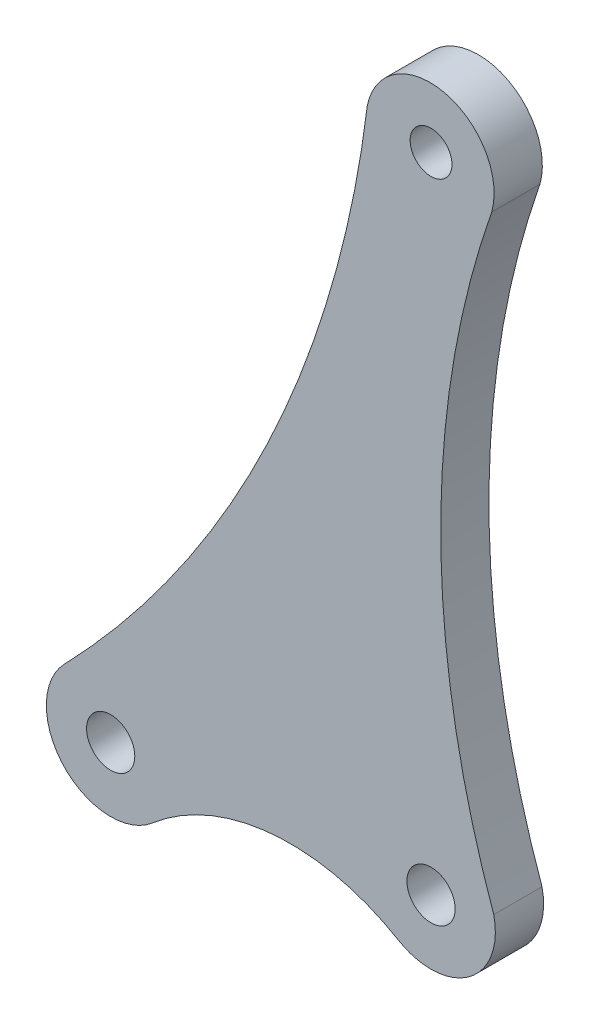
ISO-10303-21;
HEADER;
FILE_DESCRIPTION(('STEP AP214'),'2;1');
FILE_NAME('part.step','',(''),(''),'','','');
FILE_SCHEMA(('AUTOMOTIVE_DESIGN { 1 0 10303 214 1 1 1 1 }'));
ENDSEC;
DATA;
#1=APPLICATION_CONTEXT('core data for automotive mechanical design processes');
#2=APPLICATION_PROTOCOL_DEFINITION('international standard','automotive_design',2000,#1);
#3=PRODUCT_CONTEXT('',#1,'mechanical');
#4=PRODUCT('Part','Part','',(#3));
#5=PRODUCT_RELATED_PRODUCT_CATEGORY('part','',(#4));
#6=PRODUCT_DEFINITION_FORMATION('','',#4);
#7=PRODUCT_DEFINITION_CONTEXT('part definition',#1,'design');
#8=PRODUCT_DEFINITION('design','',#6,#7);
#9=PRODUCT_DEFINITION_SHAPE('','',#8);
#10=(LENGTH_UNIT() NAMED_UNIT(*) SI_UNIT(.MILLI.,.METRE.));
#11=(NAMED_UNIT(*) PLANE_ANGLE_UNIT() SI_UNIT($,.RADIAN.));
#12=(NAMED_UNIT(*) SI_UNIT($,.STERADIAN.) SOLID_ANGLE_UNIT());
#13=UNCERTAINTY_MEASURE_WITH_UNIT(LENGTH_MEASURE(1.E-05),#10,'distance_accuracy_value','');
#14=(GEOMETRIC_REPRESENTATION_CONTEXT(3) GLOBAL_UNCERTAINTY_ASSIGNED_CONTEXT((#13)) GLOBAL_UNIT_ASSIGNED_CONTEXT((#10,
#11,#12)) REPRESENTATION_CONTEXT('',''));
#15=CARTESIAN_POINT('',(0.,0.,0.));
#16=DIRECTION('',(0.,0.,1.));
#17=DIRECTION('',(1.,0.,0.));
#18=AXIS2_PLACEMENT_3D('',#15,#16,#17);
#19=CARTESIAN_POINT('',(0.761207058722107,54.9966930163416,3.));
#20=DIRECTION('',(0.,0.,1.));
#21=DIRECTION('',(1.,0.,0.));
#22=AXIS2_PLACEMENT_3D('',#19,#20,#21);
#23=PLANE('',#22);
#24=CARTESIAN_POINT('',(17.037547355421,8.92471756310351,3.));
#25=DIRECTION('',(0.,0.,1.));
#26=DIRECTION('',(1.,0.,0.));
#27=AXIS2_PLACEMENT_3D('',#24,#25,#26);
#28=CIRCLE('',#27,1.5);
#29=CARTESIAN_POINT('',(18.537547355421,8.92471756310351,3.));
#30=VERTEX_POINT('',#29);
#31=EDGE_CURVE('E165',#30,#30,#28,.T.);
#32=ORIENTED_EDGE('',*,*,#31,.F.);
#33=EDGE_LOOP('',(#32));
#34=FACE_BOUND('',#33,.T.);
#35=CARTESIAN_POINT('',(-35.3816029465135,59.570845149379,3.));
#36=DIRECTION('',(0.,0.,-1.));
#37=DIRECTION('',(1.,0.,0.));
#38=AXIS2_PLACEMENT_3D('',#35,#36,#37);
#39=CIRCLE('',#38,68.8890351769737);
#40=CARTESIAN_POINT('',(32.9915944209716,51.1562715201774,3.));
#41=VERTEX_POINT('',#40);
#42=CARTESIAN_POINT('',(14.1612277016737,11.7042900301794,3.));
#43=VERTEX_POINT('',#42);
#44=EDGE_CURVE('E138',#41,#43,#39,.T.);
#45=ORIENTED_EDGE('',*,*,#44,.T.);
#46=CARTESIAN_POINT('',(17.0380745657417,8.92509417856976,3.));
#47=DIRECTION('',(0.,0.,1.));
#48=DIRECTION('',(1.,0.,0.));
#49=AXIS2_PLACEMENT_3D('',#46,#47,#48);
#50=CIRCLE('',#49,4.00002218255129);
#51=CARTESIAN_POINT('',(19.6440331307402,5.8904348206824,3.));
#52=VERTEX_POINT('',#51);
#53=EDGE_CURVE('E91',#43,#52,#50,.T.);
#54=ORIENTED_EDGE('',*,*,#53,.T.);
#55=CARTESIAN_POINT('',(28.2139675514032,-4.08544303520237,3.));
#56=DIRECTION('',(0.,0.,-1.));
#57=DIRECTION('',(1.,0.,0.));
#58=AXIS2_PLACEMENT_3D('',#55,#56,#57);
#59=CIRCLE('',#58,13.151498582671);
#60=CARTESIAN_POINT('',(34.9213771509021,7.22705321604772,3.));
#61=VERTEX_POINT('',#60);
#62=EDGE_CURVE('E150',#52,#61,#59,.T.);
#63=ORIENTED_EDGE('',*,*,#62,.T.);
#64=CARTESIAN_POINT('',(36.9614276657235,10.6677663383811,3.));
#65=DIRECTION('',(0.,0.,1.));
#66=DIRECTION('',(1.,0.,0.));
#67=AXIS2_PLACEMENT_3D('',#64,#65,#66);
#68=CIRCLE('',#67,4.00003911146132);
#69=CARTESIAN_POINT('',(36.4627287067595,6.69893625363967,3.));
#70=VERTEX_POINT('',#69);
#71=EDGE_CURVE('E107',#61,#70,#68,.T.);
#72=ORIENTED_EDGE('',*,*,#71,.T.);
#73=CARTESIAN_POINT('',(36.956219654694,10.6744713366131,3.));
#74=DIRECTION('',(0.,0.,1.));
#75=DIRECTION('',(1.,0.,0.));
#76=AXIS2_PLACEMENT_3D('',#73,#74,#75);
#77=CIRCLE('',#76,4.00604699318991);
#78=CARTESIAN_POINT('',(40.8619361875601,11.5654207608467,3.));
#79=VERTEX_POINT('',#78);
#80=EDGE_CURVE('E101',#70,#79,#77,.T.);
#81=ORIENTED_EDGE('',*,*,#80,.T.);
#82=CARTESIAN_POINT('',(94.3239691330171,30.6328080953282,3.));
#83=DIRECTION('',(0.,0.,-1.));
#84=DIRECTION('',(1.,0.,0.));
#85=AXIS2_PLACEMENT_3D('',#82,#83,#84);
#86=CIRCLE('',#85,56.7604988211368);
#87=CARTESIAN_POINT('',(40.7336923062268,49.3367236226251,3.));
#88=VERTEX_POINT('',#87);
#89=EDGE_CURVE('E105',#79,#88,#86,.T.);
#90=ORIENTED_EDGE('',*,*,#89,.T.);
#91=CARTESIAN_POINT('',(36.9040170639577,50.4225408833042,3.));
#92=DIRECTION('',(0.,0.,1.));
#93=DIRECTION('',(1.,0.,0.));
#94=AXIS2_PLACEMENT_3D('',#91,#92,#93);
#95=CIRCLE('',#94,3.98062954629504);
#96=EDGE_CURVE('E51',#88,#41,#95,.T.);
#97=ORIENTED_EDGE('',*,*,#96,.T.);
#98=EDGE_LOOP('',(#45,#54,#63,#72,#81,#90,#97));
#99=FACE_BOUND('',#98,.T.);
#100=CARTESIAN_POINT('',(36.9616073475727,50.6676642755564,3.));
#101=DIRECTION('',(0.,0.,1.));
#102=DIRECTION('',(1.,0.,0.));
#103=AXIS2_PLACEMENT_3D('',#100,#101,#102);
#104=CIRCLE('',#103,1.3);
#105=CARTESIAN_POINT('',(38.2616073475727,50.6676642755564,3.));
#106=VERTEX_POINT('',#105);
#107=EDGE_CURVE('E129',#106,#106,#104,.T.);
#108=ORIENTED_EDGE('',*,*,#107,.F.);
#109=EDGE_LOOP('',(#108));
#110=FACE_BOUND('',#109,.T.);
#111=CARTESIAN_POINT('',(36.961484603523,10.6676207629864,3.));
#112=DIRECTION('',(0.,0.,1.));
#113=DIRECTION('',(1.,0.,0.));
#114=AXIS2_PLACEMENT_3D('',#111,#112,#113);
#115=CIRCLE('',#114,1.5);
#116=CARTESIAN_POINT('',(38.461484603523,10.6676207629864,3.));
#117=VERTEX_POINT('',#116);
#118=EDGE_CURVE('E171',#117,#117,#115,.T.);
#119=ORIENTED_EDGE('',*,*,#118,.F.);
#120=EDGE_LOOP('',(#119));
#121=FACE_BOUND('',#120,.T.);
#122=ADVANCED_FACE('F34',(#34,#99,#110,#121),#23,.T.);
#123=CARTESIAN_POINT('',(0.761207058722107,54.9966930163416,0.));
#124=DIRECTION('',(0.,0.,1.));
#125=DIRECTION('',(1.,0.,0.));
#126=AXIS2_PLACEMENT_3D('',#123,#124,#125);
#127=PLANE('',#126);
#128=CARTESIAN_POINT('',(-35.3816029465135,59.570845149379,0.));
#129=DIRECTION('',(0.,0.,-1.));
#130=DIRECTION('',(1.,0.,0.));
#131=AXIS2_PLACEMENT_3D('',#128,#129,#130);
#132=CIRCLE('',#131,68.8890351769737);
#133=CARTESIAN_POINT('',(32.9915944209716,51.1562715201774,0.));
#134=VERTEX_POINT('',#133);
#135=CARTESIAN_POINT('',(14.1612277016737,11.7042900301794,0.));
#136=VERTEX_POINT('',#135);
#137=EDGE_CURVE('E125',#134,#136,#132,.T.);
#138=ORIENTED_EDGE('',*,*,#137,.F.);
#139=CARTESIAN_POINT('',(36.9040170639577,50.4225408833042,0.));
#140=DIRECTION('',(0.,0.,1.));
#141=DIRECTION('',(1.,0.,0.));
#142=AXIS2_PLACEMENT_3D('',#139,#140,#141);
#143=CIRCLE('',#142,3.98062954629504);
#144=CARTESIAN_POINT('',(40.7336923062268,49.3367236226251,0.));
#145=VERTEX_POINT('',#144);
#146=EDGE_CURVE('E83',#145,#134,#143,.T.);
#147=ORIENTED_EDGE('',*,*,#146,.F.);
#148=CARTESIAN_POINT('',(94.3239691330171,30.6328080953282,0.));
#149=DIRECTION('',(0.,0.,-1.));
#150=DIRECTION('',(1.,0.,0.));
#151=AXIS2_PLACEMENT_3D('',#148,#149,#150);
#152=CIRCLE('',#151,56.7604988211368);
#153=CARTESIAN_POINT('',(40.8619361875601,11.5654207608467,0.));
#154=VERTEX_POINT('',#153);
#155=EDGE_CURVE('E77',#154,#145,#152,.T.);
#156=ORIENTED_EDGE('',*,*,#155,.F.);
#157=CARTESIAN_POINT('',(36.956219654694,10.6744713366131,0.));
#158=DIRECTION('',(0.,0.,1.));
#159=DIRECTION('',(1.,0.,0.));
#160=AXIS2_PLACEMENT_3D('',#157,#158,#159);
#161=CIRCLE('',#160,4.00604699318991);
#162=CARTESIAN_POINT('',(36.4627287067595,6.69893625363967,0.));
#163=VERTEX_POINT('',#162);
#164=EDGE_CURVE('E115',#163,#154,#161,.T.);
#165=ORIENTED_EDGE('',*,*,#164,.F.);
#166=CARTESIAN_POINT('',(36.9614276657235,10.6677663383811,0.));
#167=DIRECTION('',(0.,0.,1.));
#168=DIRECTION('',(1.,0.,0.));
#169=AXIS2_PLACEMENT_3D('',#166,#167,#168);
#170=CIRCLE('',#169,4.00003911146132);
#171=CARTESIAN_POINT('',(34.9213771509021,7.22705321604772,0.));
#172=VERTEX_POINT('',#171);
#173=EDGE_CURVE('E133',#172,#163,#170,.T.);
#174=ORIENTED_EDGE('',*,*,#173,.F.);
#175=CARTESIAN_POINT('',(28.2139675514032,-4.08544303520237,0.));
#176=DIRECTION('',(0.,0.,-1.));
#177=DIRECTION('',(1.,0.,0.));
#178=AXIS2_PLACEMENT_3D('',#175,#176,#177);
#179=CIRCLE('',#178,13.151498582671);
#180=CARTESIAN_POINT('',(19.6440331307402,5.8904348206824,0.));
#181=VERTEX_POINT('',#180);
#182=EDGE_CURVE('E131',#181,#172,#179,.T.);
#183=ORIENTED_EDGE('',*,*,#182,.F.);
#184=CARTESIAN_POINT('',(17.0380745657417,8.92509417856976,0.));
#185=DIRECTION('',(0.,0.,1.));
#186=DIRECTION('',(1.,0.,0.));
#187=AXIS2_PLACEMENT_3D('',#184,#185,#186);
#188=CIRCLE('',#187,4.00002218255129);
#189=EDGE_CURVE('E128',#136,#181,#188,.T.);
#190=ORIENTED_EDGE('',*,*,#189,.F.);
#191=EDGE_LOOP('',(#138,#147,#156,#165,#174,#183,#190));
#192=FACE_BOUND('',#191,.T.);
#193=CARTESIAN_POINT('',(36.9616073475727,50.6676642755564,0.));
#194=DIRECTION('',(0.,0.,1.));
#195=DIRECTION('',(1.,0.,0.));
#196=AXIS2_PLACEMENT_3D('',#193,#194,#195);
#197=CIRCLE('',#196,1.3);
#198=CARTESIAN_POINT('',(38.2616073475727,50.6676642755564,0.));
#199=VERTEX_POINT('',#198);
#200=EDGE_CURVE('E162',#199,#199,#197,.T.);
#201=ORIENTED_EDGE('',*,*,#200,.T.);
#202=EDGE_LOOP('',(#201));
#203=FACE_BOUND('',#202,.T.);
#204=CARTESIAN_POINT('',(17.037547355421,8.92471756310351,0.));
#205=DIRECTION('',(0.,0.,1.));
#206=DIRECTION('',(1.,0.,0.));
#207=AXIS2_PLACEMENT_3D('',#204,#205,#206);
#208=CIRCLE('',#207,1.5);
#209=CARTESIAN_POINT('',(18.537547355421,8.92471756310351,0.));
#210=VERTEX_POINT('',#209);
#211=EDGE_CURVE('E168',#210,#210,#208,.T.);
#212=ORIENTED_EDGE('',*,*,#211,.T.);
#213=EDGE_LOOP('',(#212));
#214=FACE_BOUND('',#213,.T.);
#215=CARTESIAN_POINT('',(36.961484603523,10.6676207629864,0.));
#216=DIRECTION('',(0.,0.,1.));
#217=DIRECTION('',(1.,0.,0.));
#218=AXIS2_PLACEMENT_3D('',#215,#216,#217);
#219=CIRCLE('',#218,1.5);
#220=CARTESIAN_POINT('',(38.461484603523,10.6676207629864,0.));
#221=VERTEX_POINT('',#220);
#222=EDGE_CURVE('E174',#221,#221,#219,.T.);
#223=ORIENTED_EDGE('',*,*,#222,.T.);
#224=EDGE_LOOP('',(#223));
#225=FACE_BOUND('',#224,.T.);
#226=ADVANCED_FACE('F154',(#192,#203,#214,#225),#127,.F.);
#227=CARTESIAN_POINT('',(-35.3816029465135,59.570845149379,3.));
#228=DIRECTION('',(0.,0.,-1.));
#229=DIRECTION('',(-1.,0.,0.));
#230=AXIS2_PLACEMENT_3D('',#227,#228,#229);
#231=CYLINDRICAL_SURFACE('',#230,68.8890351769737);
#232=ORIENTED_EDGE('',*,*,#137,.T.);
#233=DIRECTION('',(0.,0.,-1.));
#234=VECTOR('',#233,1.);
#235=CARTESIAN_POINT('',(14.1612277016737,11.7042900301794,3.));
#236=LINE('',#235,#234);
#237=EDGE_CURVE('E11',#43,#136,#236,.T.);
#238=ORIENTED_EDGE('',*,*,#237,.F.);
#239=ORIENTED_EDGE('',*,*,#44,.F.);
#240=DIRECTION('',(0.,0.,-1.));
#241=VECTOR('',#240,1.);
#242=CARTESIAN_POINT('',(32.9915944209716,51.1562715201774,3.));
#243=LINE('',#242,#241);
#244=EDGE_CURVE('E121',#41,#134,#243,.T.);
#245=ORIENTED_EDGE('',*,*,#244,.T.);
#246=EDGE_LOOP('',(#232,#238,#239,#245));
#247=FACE_BOUND('',#246,.T.);
#248=ADVANCED_FACE('F36',(#247),#231,.F.);
#249=CARTESIAN_POINT('',(17.0380745657417,8.92509417856976,3.));
#250=DIRECTION('',(0.,0.,-1.));
#251=DIRECTION('',(-1.,0.,0.));
#252=AXIS2_PLACEMENT_3D('',#249,#250,#251);
#253=CYLINDRICAL_SURFACE('',#252,4.00002218255129);
#254=ORIENTED_EDGE('',*,*,#189,.T.);
#255=DIRECTION('',(0.,0.,-1.));
#256=VECTOR('',#255,1.);
#257=CARTESIAN_POINT('',(19.6440331307402,5.8904348206824,3.));
#258=LINE('',#257,#256);
#259=EDGE_CURVE('E43',#52,#181,#258,.T.);
#260=ORIENTED_EDGE('',*,*,#259,.F.);
#261=ORIENTED_EDGE('',*,*,#53,.F.);
#262=ORIENTED_EDGE('',*,*,#237,.T.);
#263=EDGE_LOOP('',(#254,#260,#261,#262));
#264=FACE_BOUND('',#263,.T.);
#265=ADVANCED_FACE('F205',(#264),#253,.T.);
#266=CARTESIAN_POINT('',(28.2139675514032,-4.08544303520237,3.));
#267=DIRECTION('',(0.,0.,-1.));
#268=DIRECTION('',(-1.,0.,0.));
#269=AXIS2_PLACEMENT_3D('',#266,#267,#268);
#270=CYLINDRICAL_SURFACE('',#269,13.151498582671);
#271=ORIENTED_EDGE('',*,*,#182,.T.);
#272=DIRECTION('',(0.,0.,-1.));
#273=VECTOR('',#272,1.);
#274=CARTESIAN_POINT('',(34.9213771509021,7.22705321604772,3.));
#275=LINE('',#274,#273);
#276=EDGE_CURVE('E142',#61,#172,#275,.T.);
#277=ORIENTED_EDGE('',*,*,#276,.F.);
#278=ORIENTED_EDGE('',*,*,#62,.F.);
#279=ORIENTED_EDGE('',*,*,#259,.T.);
#280=EDGE_LOOP('',(#271,#277,#278,#279));
#281=FACE_BOUND('',#280,.T.);
#282=ADVANCED_FACE('F148',(#281),#270,.F.);
#283=CARTESIAN_POINT('',(36.9614276657235,10.6677663383811,3.));
#284=DIRECTION('',(0.,0.,-1.));
#285=DIRECTION('',(-1.,0.,0.));
#286=AXIS2_PLACEMENT_3D('',#283,#284,#285);
#287=CYLINDRICAL_SURFACE('',#286,4.00003911146132);
#288=ORIENTED_EDGE('',*,*,#173,.T.);
#289=DIRECTION('',(0.,0.,-1.));
#290=VECTOR('',#289,1.);
#291=CARTESIAN_POINT('',(36.4627287067595,6.69893625363967,3.));
#292=LINE('',#291,#290);
#293=EDGE_CURVE('E116',#70,#163,#292,.T.);
#294=ORIENTED_EDGE('',*,*,#293,.F.);
#295=ORIENTED_EDGE('',*,*,#71,.F.);
#296=ORIENTED_EDGE('',*,*,#276,.T.);
#297=EDGE_LOOP('',(#288,#294,#295,#296));
#298=FACE_BOUND('',#297,.T.);
#299=ADVANCED_FACE('F157',(#298),#287,.T.);
#300=CARTESIAN_POINT('',(36.956219654694,10.6744713366131,3.));
#301=DIRECTION('',(0.,0.,-1.));
#302=DIRECTION('',(-1.,0.,0.));
#303=AXIS2_PLACEMENT_3D('',#300,#301,#302);
#304=CYLINDRICAL_SURFACE('',#303,4.00604699318991);
#305=ORIENTED_EDGE('',*,*,#164,.T.);
#306=DIRECTION('',(0.,0.,-1.));
#307=VECTOR('',#306,1.);
#308=CARTESIAN_POINT('',(40.8619361875601,11.5654207608467,3.));
#309=LINE('',#308,#307);
#310=EDGE_CURVE('E112',#79,#154,#309,.T.);
#311=ORIENTED_EDGE('',*,*,#310,.F.);
#312=ORIENTED_EDGE('',*,*,#80,.F.);
#313=ORIENTED_EDGE('',*,*,#293,.T.);
#314=EDGE_LOOP('',(#305,#311,#312,#313));
#315=FACE_BOUND('',#314,.T.);
#316=ADVANCED_FACE('F113',(#315),#304,.T.);
#317=CARTESIAN_POINT('',(94.3239691330171,30.6328080953282,3.));
#318=DIRECTION('',(0.,0.,-1.));
#319=DIRECTION('',(-1.,0.,0.));
#320=AXIS2_PLACEMENT_3D('',#317,#318,#319);
#321=CYLINDRICAL_SURFACE('',#320,56.7604988211368);
#322=ORIENTED_EDGE('',*,*,#155,.T.);
#323=DIRECTION('',(0.,0.,-1.));
#324=VECTOR('',#323,1.);
#325=CARTESIAN_POINT('',(40.7336923062268,49.3367236226251,3.));
#326=LINE('',#325,#324);
#327=EDGE_CURVE('E117',#88,#145,#326,.T.);
#328=ORIENTED_EDGE('',*,*,#327,.F.);
#329=ORIENTED_EDGE('',*,*,#89,.F.);
#330=ORIENTED_EDGE('',*,*,#310,.T.);
#331=EDGE_LOOP('',(#322,#328,#329,#330));
#332=FACE_BOUND('',#331,.T.);
#333=ADVANCED_FACE('F119',(#332),#321,.F.);
#334=CARTESIAN_POINT('',(36.9040170639577,50.4225408833042,3.));
#335=DIRECTION('',(0.,0.,-1.));
#336=DIRECTION('',(-1.,0.,0.));
#337=AXIS2_PLACEMENT_3D('',#334,#335,#336);
#338=CYLINDRICAL_SURFACE('',#337,3.98062954629504);
#339=ORIENTED_EDGE('',*,*,#146,.T.);
#340=ORIENTED_EDGE('',*,*,#244,.F.);
#341=ORIENTED_EDGE('',*,*,#96,.F.);
#342=ORIENTED_EDGE('',*,*,#327,.T.);
#343=EDGE_LOOP('',(#339,#340,#341,#342));
#344=FACE_BOUND('',#343,.T.);
#345=ADVANCED_FACE('F195',(#344),#338,.T.);
#346=CARTESIAN_POINT('',(36.9616073475727,50.6676642755564,3.));
#347=DIRECTION('',(0.,0.,-1.));
#348=DIRECTION('',(-1.,0.,0.));
#349=AXIS2_PLACEMENT_3D('',#346,#347,#348);
#350=CYLINDRICAL_SURFACE('',#349,1.3);
#351=ORIENTED_EDGE('',*,*,#107,.T.);
#352=EDGE_LOOP('',(#351));
#353=FACE_BOUND('',#352,.T.);
#354=ORIENTED_EDGE('',*,*,#200,.F.);
#355=EDGE_LOOP('',(#354));
#356=FACE_BOUND('',#355,.T.);
#357=ADVANCED_FACE('F192',(#353,#356),#350,.F.);
#358=CARTESIAN_POINT('',(17.037547355421,8.92471756310351,3.));
#359=DIRECTION('',(0.,0.,-1.));
#360=DIRECTION('',(-1.,0.,0.));
#361=AXIS2_PLACEMENT_3D('',#358,#359,#360);
#362=CYLINDRICAL_SURFACE('',#361,1.5);
#363=ORIENTED_EDGE('',*,*,#31,.T.);
#364=EDGE_LOOP('',(#363));
#365=FACE_BOUND('',#364,.T.);
#366=ORIENTED_EDGE('',*,*,#211,.F.);
#367=EDGE_LOOP('',(#366));
#368=FACE_BOUND('',#367,.T.);
#369=ADVANCED_FACE('F264',(#365,#368),#362,.F.);
#370=CARTESIAN_POINT('',(36.961484603523,10.6676207629864,3.));
#371=DIRECTION('',(0.,0.,-1.));
#372=DIRECTION('',(-1.,0.,0.));
#373=AXIS2_PLACEMENT_3D('',#370,#371,#372);
#374=CYLINDRICAL_SURFACE('',#373,1.5);
#375=ORIENTED_EDGE('',*,*,#118,.T.);
#376=EDGE_LOOP('',(#375));
#377=FACE_BOUND('',#376,.T.);
#378=ORIENTED_EDGE('',*,*,#222,.F.);
#379=EDGE_LOOP('',(#378));
#380=FACE_BOUND('',#379,.T.);
#381=ADVANCED_FACE('F180',(#377,#380),#374,.F.);
#382=CLOSED_SHELL('',(#122,#226,#248,#265,#282,#299,#316,#333,#345,#357,#369,#381));
#383=MANIFOLD_SOLID_BREP('B2',#382);
#384=ADVANCED_BREP_SHAPE_REPRESENTATION('',(#18,#383),#14);
#385=SHAPE_DEFINITION_REPRESENTATION(#9,#384);
ENDSEC;
END-ISO-10303-21;
